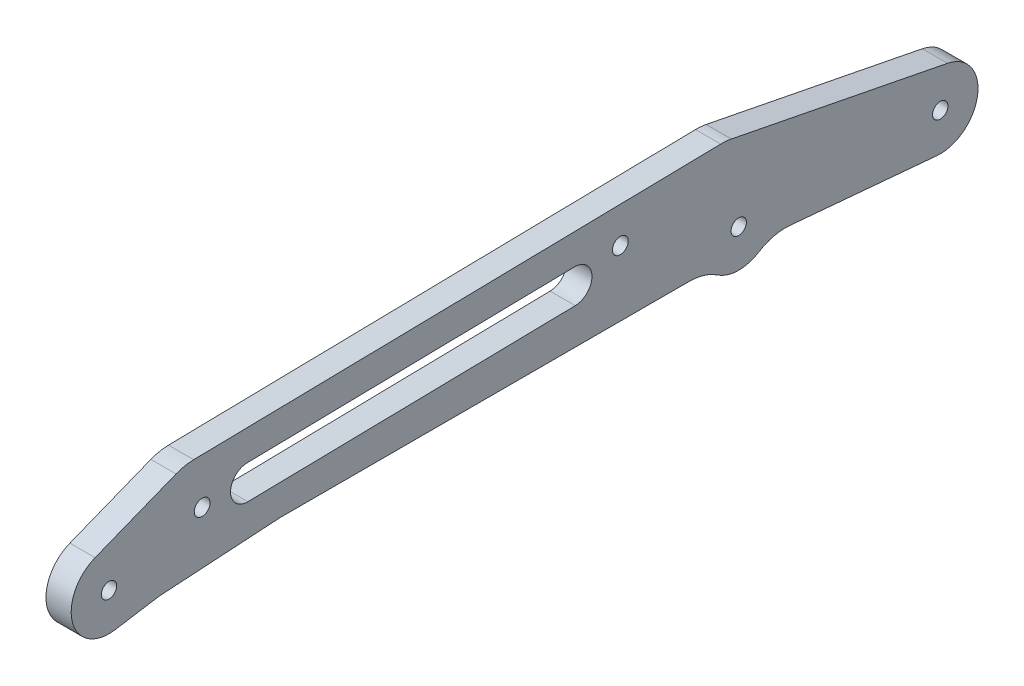
ISO-10303-21;
HEADER;
FILE_DESCRIPTION(('STEP AP214'),'2;1');
FILE_NAME('part.step','',(''),(''),'','','');
FILE_SCHEMA(('AUTOMOTIVE_DESIGN { 1 0 10303 214 1 1 1 1 }'));
ENDSEC;
DATA;
#1=APPLICATION_CONTEXT('core data for automotive mechanical design processes');
#2=APPLICATION_PROTOCOL_DEFINITION('international standard','automotive_design',2000,#1);
#3=PRODUCT_CONTEXT('',#1,'mechanical');
#4=PRODUCT('Part','Part','',(#3));
#5=PRODUCT_RELATED_PRODUCT_CATEGORY('part','',(#4));
#6=PRODUCT_DEFINITION_FORMATION('','',#4);
#7=PRODUCT_DEFINITION_CONTEXT('part definition',#1,'design');
#8=PRODUCT_DEFINITION('design','',#6,#7);
#9=PRODUCT_DEFINITION_SHAPE('','',#8);
#10=(LENGTH_UNIT() NAMED_UNIT(*) SI_UNIT(.MILLI.,.METRE.));
#11=(NAMED_UNIT(*) PLANE_ANGLE_UNIT() SI_UNIT($,.RADIAN.));
#12=(NAMED_UNIT(*) SI_UNIT($,.STERADIAN.) SOLID_ANGLE_UNIT());
#13=UNCERTAINTY_MEASURE_WITH_UNIT(LENGTH_MEASURE(1.E-05),#10,'distance_accuracy_value','');
#14=(GEOMETRIC_REPRESENTATION_CONTEXT(3) GLOBAL_UNCERTAINTY_ASSIGNED_CONTEXT((#13)) GLOBAL_UNIT_ASSIGNED_CONTEXT((#10,
#11,#12)) REPRESENTATION_CONTEXT('',''));
#15=CARTESIAN_POINT('',(0.,0.,0.));
#16=DIRECTION('',(0.,0.,1.));
#17=DIRECTION('',(1.,0.,0.));
#18=AXIS2_PLACEMENT_3D('',#15,#16,#17);
#19=CARTESIAN_POINT('',(2.5,-15.9506465412037,113.898149240446));
#20=DIRECTION('',(-1.,0.,0.));
#21=DIRECTION('',(0.,0.,1.));
#22=AXIS2_PLACEMENT_3D('',#19,#20,#21);
#23=CYLINDRICAL_SURFACE('',#22,9.99999999999999);
#24=DIRECTION('',(1.,0.,0.));
#25=VECTOR('',#24,1.);
#26=CARTESIAN_POINT('',(2.5,-6.07543657815531,115.473023262617));
#27=LINE('',#26,#25);
#28=CARTESIAN_POINT('',(-2.5,-6.0754365781553,115.473023262617));
#29=VERTEX_POINT('',#28);
#30=CARTESIAN_POINT('',(2.5,-6.07543657815531,115.473023262617));
#31=VERTEX_POINT('',#30);
#32=EDGE_CURVE('E166',#29,#31,#27,.T.);
#33=ORIENTED_EDGE('',*,*,#32,.F.);
#34=CARTESIAN_POINT('',(-2.5,-15.9506465412037,113.898149240446));
#35=DIRECTION('',(-1.,0.,0.));
#36=DIRECTION('',(0.,0.,1.));
#37=AXIS2_PLACEMENT_3D('',#34,#35,#36);
#38=CIRCLE('',#37,9.99999999999999);
#39=CARTESIAN_POINT('',(-2.5,-5.97012075637485,114.521932101997));
#40=VERTEX_POINT('',#39);
#41=EDGE_CURVE('E19',#40,#29,#38,.F.);
#42=ORIENTED_EDGE('',*,*,#41,.F.);
#43=DIRECTION('',(1.,0.,0.));
#44=VECTOR('',#43,1.);
#45=CARTESIAN_POINT('',(2.5,-5.97012075637486,114.521932101997));
#46=LINE('',#45,#44);
#47=CARTESIAN_POINT('',(2.5,-5.97012075637485,114.521932101997));
#48=VERTEX_POINT('',#47);
#49=EDGE_CURVE('E238',#40,#48,#46,.T.);
#50=ORIENTED_EDGE('',*,*,#49,.T.);
#51=CARTESIAN_POINT('',(2.5,-15.9506465412037,113.898149240446));
#52=DIRECTION('',(-1.,0.,0.));
#53=DIRECTION('',(0.,0.,1.));
#54=AXIS2_PLACEMENT_3D('',#51,#52,#53);
#55=CIRCLE('',#54,9.99999999999999);
#56=EDGE_CURVE('E167',#31,#48,#55,.T.);
#57=ORIENTED_EDGE('',*,*,#56,.F.);
#58=EDGE_LOOP('',(#33,#42,#50,#57));
#59=FACE_BOUND('',#58,.T.);
#60=ADVANCED_FACE('F16',(#59),#23,.F.);
#61=CARTESIAN_POINT('',(2.5,-14.5,90.687804581186));
#62=DIRECTION('',(1.,0.,0.));
#63=DIRECTION('',(0.,0.,-1.));
#64=AXIS2_PLACEMENT_3D('',#61,#62,#63);
#65=CYLINDRICAL_SURFACE('',#64,9.99999999999999);
#66=DIRECTION('',(1.,0.,0.));
#67=VECTOR('',#66,1.);
#68=CARTESIAN_POINT('',(2.5,-4.51947421517113,91.3115874427379));
#69=LINE('',#68,#67);
#70=CARTESIAN_POINT('',(2.5,-4.51947421517113,91.3115874427379));
#71=VERTEX_POINT('',#70);
#72=CARTESIAN_POINT('',(-2.5,-4.51947421517113,91.3115874427379));
#73=VERTEX_POINT('',#72);
#74=EDGE_CURVE('E237',#71,#73,#69,.F.);
#75=ORIENTED_EDGE('',*,*,#74,.T.);
#76=CARTESIAN_POINT('',(-2.5,-14.5,90.687804581186));
#77=DIRECTION('',(1.,0.,0.));
#78=DIRECTION('',(0.,0.,-1.));
#79=AXIS2_PLACEMENT_3D('',#76,#77,#78);
#80=CIRCLE('',#79,9.99999999999999);
#81=CARTESIAN_POINT('',(-2.5,-4.50000000000001,90.687804581186));
#82=VERTEX_POINT('',#81);
#83=EDGE_CURVE('E164',#82,#73,#80,.T.);
#84=ORIENTED_EDGE('',*,*,#83,.F.);
#85=DIRECTION('',(1.,0.,0.));
#86=VECTOR('',#85,1.);
#87=CARTESIAN_POINT('',(2.5,-4.50000000000001,90.687804581186));
#88=LINE('',#87,#86);
#89=CARTESIAN_POINT('',(2.5,-4.50000000000001,90.687804581186));
#90=VERTEX_POINT('',#89);
#91=EDGE_CURVE('E234',#82,#90,#88,.T.);
#92=ORIENTED_EDGE('',*,*,#91,.T.);
#93=CARTESIAN_POINT('',(2.5,-14.5,90.687804581186));
#94=DIRECTION('',(1.,0.,0.));
#95=DIRECTION('',(0.,0.,-1.));
#96=AXIS2_PLACEMENT_3D('',#93,#94,#95);
#97=CIRCLE('',#96,9.99999999999999);
#98=EDGE_CURVE('E322',#71,#90,#97,.F.);
#99=ORIENTED_EDGE('',*,*,#98,.F.);
#100=EDGE_LOOP('',(#75,#84,#92,#99));
#101=FACE_BOUND('',#100,.T.);
#102=ADVANCED_FACE('F330',(#101),#65,.F.);
#103=CARTESIAN_POINT('',(2.5,0.,0.));
#104=DIRECTION('',(1.,0.,0.));
#105=DIRECTION('',(0.,0.,-1.));
#106=AXIS2_PLACEMENT_3D('',#103,#104,#105);
#107=PLANE('',#106);
#108=CARTESIAN_POINT('',(2.5,0.,125.));
#109=DIRECTION('',(-1.,0.,0.));
#110=DIRECTION('',(0.,0.,1.));
#111=AXIS2_PLACEMENT_3D('',#108,#109,#110);
#112=CIRCLE('',#111,1.525);
#113=CARTESIAN_POINT('',(2.5,0.,126.525));
#114=VERTEX_POINT('',#113);
#115=EDGE_CURVE('E298',#114,#114,#112,.T.);
#116=ORIENTED_EDGE('',*,*,#115,.T.);
#117=EDGE_LOOP('',(#116));
#118=FACE_BOUND('',#117,.T.);
#119=CARTESIAN_POINT('',(2.5,0.,0.));
#120=DIRECTION('',(-1.,0.,0.));
#121=DIRECTION('',(0.,0.,1.));
#122=AXIS2_PLACEMENT_3D('',#119,#120,#121);
#123=CIRCLE('',#122,1.525);
#124=CARTESIAN_POINT('',(2.5,0.,1.525));
#125=VERTEX_POINT('',#124);
#126=EDGE_CURVE('E191',#125,#125,#123,.T.);
#127=ORIENTED_EDGE('',*,*,#126,.T.);
#128=EDGE_LOOP('',(#127));
#129=FACE_BOUND('',#128,.T.);
#130=CARTESIAN_POINT('',(2.5,4.80591857120444,97.4943767977606));
#131=DIRECTION('',(-1.,0.,0.));
#132=DIRECTION('',(0.,0.,1.));
#133=AXIS2_PLACEMENT_3D('',#130,#131,#132);
#134=CIRCLE('',#133,3.375);
#135=CARTESIAN_POINT('',(2.5,1.43150251912931,97.4315969642336));
#136=VERTEX_POINT('',#135);
#137=CARTESIAN_POINT('',(2.5,8.18033462327958,97.5571566312875));
#138=VERTEX_POINT('',#137);
#139=EDGE_CURVE('E198',#136,#138,#134,.T.);
#140=ORIENTED_EDGE('',*,*,#139,.T.);
#141=DIRECTION('',(0.,-0.0186014321561424,0.999826978392632));
#142=VECTOR('',#141,1.);
#143=CARTESIAN_POINT('',(2.5,9.99189296650175,0.185895683097711));
#144=LINE('',#143,#142);
#145=CARTESIAN_POINT('',(2.5,9.38942771342883,32.5684030357665));
#146=VERTEX_POINT('',#145);
#147=EDGE_CURVE('E194',#138,#146,#144,.F.);
#148=ORIENTED_EDGE('',*,*,#147,.T.);
#149=CARTESIAN_POINT('',(2.5,6.0150116613537,32.5056232022395));
#150=DIRECTION('',(-1.,0.,0.));
#151=DIRECTION('',(0.,0.,1.));
#152=AXIS2_PLACEMENT_3D('',#149,#150,#151);
#153=CIRCLE('',#152,3.375);
#154=CARTESIAN_POINT('',(2.5,2.64059560927856,32.4428433687125));
#155=VERTEX_POINT('',#154);
#156=EDGE_CURVE('E192',#146,#155,#153,.T.);
#157=ORIENTED_EDGE('',*,*,#156,.T.);
#158=DIRECTION('',(0.,-0.0186014321561424,0.999826978392632));
#159=VECTOR('',#158,1.);
#160=CARTESIAN_POINT('',(2.5,3.24306086235148,0.0603360160437497));
#161=LINE('',#160,#159);
#162=EDGE_CURVE('E202',#136,#155,#161,.F.);
#163=ORIENTED_EDGE('',*,*,#162,.F.);
#164=EDGE_LOOP('',(#140,#148,#157,#163));
#165=FACE_BOUND('',#164,.T.);
#166=CARTESIAN_POINT('',(2.5,4.99999999999999,106.5));
#167=DIRECTION('',(-1.,0.,0.));
#168=DIRECTION('',(0.,0.,1.));
#169=AXIS2_PLACEMENT_3D('',#166,#167,#168);
#170=CIRCLE('',#169,1.57499999999999);
#171=CARTESIAN_POINT('',(2.5,4.99999999999999,108.075));
#172=VERTEX_POINT('',#171);
#173=EDGE_CURVE('E250',#172,#172,#170,.T.);
#174=ORIENTED_EDGE('',*,*,#173,.T.);
#175=EDGE_LOOP('',(#174));
#176=FACE_BOUND('',#175,.T.);
#177=CARTESIAN_POINT('',(2.5,8.5,23.5));
#178=DIRECTION('',(-1.,0.,0.));
#179=DIRECTION('',(0.,0.,1.));
#180=AXIS2_PLACEMENT_3D('',#177,#178,#179);
#181=CIRCLE('',#180,1.575);
#182=CARTESIAN_POINT('',(2.5,8.5,25.075));
#183=VERTEX_POINT('',#182);
#184=EDGE_CURVE('E209',#183,#183,#181,.T.);
#185=ORIENTED_EDGE('',*,*,#184,.T.);
#186=EDGE_LOOP('',(#185));
#187=FACE_BOUND('',#186,.T.);
#188=DIRECTION('',(0.,-0.0887576580011616,-0.99605325065789));
#189=VECTOR('',#188,1.);
#190=CARTESIAN_POINT('',(2.5,-3.93410522902064,0.350565560854665));
#191=LINE('',#190,#189);
#192=CARTESIAN_POINT('',(2.5,-7.47039937993417,-39.3343175649913));
#193=VERTEX_POINT('',#192);
#194=CARTESIAN_POINT('',(2.5,-4.87198454255356,-10.174472616212));
#195=VERTEX_POINT('',#194);
#196=EDGE_CURVE('E221',#193,#195,#191,.F.);
#197=ORIENTED_EDGE('',*,*,#196,.F.);
#198=CARTESIAN_POINT('',(2.5,0.,-40.));
#199=DIRECTION('',(-1.,0.,0.));
#200=DIRECTION('',(0.,0.,1.));
#201=AXIS2_PLACEMENT_3D('',#198,#199,#200);
#202=CIRCLE('',#201,7.5);
#203=CARTESIAN_POINT('',(2.5,7.35909794826338,-41.4469545216992));
#204=VERTEX_POINT('',#203);
#205=EDGE_CURVE('E218',#204,#193,#202,.T.);
#206=ORIENTED_EDGE('',*,*,#205,.F.);
#207=DIRECTION('',(0.,0.192927269559888,0.981213059768451));
#208=VECTOR('',#207,1.);
#209=CARTESIAN_POINT('',(2.5,14.9312082073686,-2.9357917752925));
#210=LINE('',#209,#208);
#211=CARTESIAN_POINT('',(2.5,15.7939988386428,1.45229414528999));
#212=VERTEX_POINT('',#211);
#213=EDGE_CURVE('E215',#212,#204,#210,.F.);
#214=ORIENTED_EDGE('',*,*,#213,.F.);
#215=CARTESIAN_POINT('',(2.5,5.98186824095833,3.38156684088887));
#216=DIRECTION('',(-1.,0.,0.));
#217=DIRECTION('',(0.,0.,1.));
#218=AXIS2_PLACEMENT_3D('',#215,#216,#217);
#219=CIRCLE('',#218,10.);
#220=CARTESIAN_POINT('',(2.5,15.9801380248846,3.56758116245029));
#221=VERTEX_POINT('',#220);
#222=EDGE_CURVE('E212',#221,#212,#219,.T.);
#223=ORIENTED_EDGE('',*,*,#222,.F.);
#224=DIRECTION('',(0.,-0.0186014321561421,0.999826978392632));
#225=VECTOR('',#224,1.);
#226=CARTESIAN_POINT('',(2.5,16.040959321814,0.298436452498867));
#227=LINE('',#226,#225);
#228=CARTESIAN_POINT('',(2.5,14.0336689941836,108.190291562629));
#229=VERTEX_POINT('',#228);
#230=EDGE_CURVE('E206',#229,#221,#227,.F.);
#231=ORIENTED_EDGE('',*,*,#230,.F.);
#232=CARTESIAN_POINT('',(2.5,4.03539921025731,108.004277241067));
#233=DIRECTION('',(-1.,0.,0.));
#234=DIRECTION('',(0.,0.,1.));
#235=AXIS2_PLACEMENT_3D('',#232,#233,#234);
#236=CIRCLE('',#235,9.99999999999999);
#237=CARTESIAN_POINT('',(2.5,13.3341269732446,111.683089819856));
#238=VERTEX_POINT('',#237);
#239=EDGE_CURVE('E259',#238,#229,#236,.T.);
#240=ORIENTED_EDGE('',*,*,#239,.F.);
#241=DIRECTION('',(0.,-0.367881257878812,0.929872776298727));
#242=VECTOR('',#241,1.);
#243=CARTESIAN_POINT('',(2.5,49.7343916487453,19.6761869214032));
#244=LINE('',#243,#242);
#245=CARTESIAN_POINT('',(2.5,6.97404582224044,127.759109434091));
#246=VERTEX_POINT('',#245);
#247=EDGE_CURVE('E248',#246,#238,#244,.F.);
#248=ORIENTED_EDGE('',*,*,#247,.F.);
#249=CARTESIAN_POINT('',(2.5,0.,125.));
#250=DIRECTION('',(-1.,0.,0.));
#251=DIRECTION('',(0.,0.,1.));
#252=AXIS2_PLACEMENT_3D('',#249,#250,#251);
#253=CIRCLE('',#252,7.50000000000001);
#254=CARTESIAN_POINT('',(2.5,-7.40640747228635,123.818844483372));
#255=VERTEX_POINT('',#254);
#256=EDGE_CURVE('E171',#255,#246,#253,.T.);
#257=ORIENTED_EDGE('',*,*,#256,.F.);
#258=DIRECTION('',(0.,0.157487402217094,-0.987520996304844));
#259=VECTOR('',#258,1.);
#260=CARTESIAN_POINT('',(2.5,12.0338570705745,1.91912971550789));
#261=LINE('',#260,#259);
#262=EDGE_CURVE('E170',#31,#255,#261,.F.);
#263=ORIENTED_EDGE('',*,*,#262,.F.);
#264=ORIENTED_EDGE('',*,*,#56,.T.);
#265=DIRECTION('',(0.,-0.0623782861551807,0.998052578482889));
#266=VECTOR('',#265,1.);
#267=CARTESIAN_POINT('',(2.5,1.18287937743191,0.0739299610894947));
#268=LINE('',#267,#266);
#269=EDGE_CURVE('E240',#48,#71,#268,.F.);
#270=ORIENTED_EDGE('',*,*,#269,.T.);
#271=ORIENTED_EDGE('',*,*,#98,.T.);
#272=DIRECTION('',(0.,0.,1.));
#273=VECTOR('',#272,1.);
#274=CARTESIAN_POINT('',(2.5,-4.50000000000001,0.));
#275=LINE('',#274,#273);
#276=CARTESIAN_POINT('',(2.5,-4.50000000000001,9.7979589711327));
#277=VERTEX_POINT('',#276);
#278=EDGE_CURVE('E233',#90,#277,#275,.F.);
#279=ORIENTED_EDGE('',*,*,#278,.T.);
#280=CARTESIAN_POINT('',(2.5,-14.5,9.7979589711327));
#281=DIRECTION('',(-1.,0.,0.));
#282=DIRECTION('',(0.,0.,1.));
#283=AXIS2_PLACEMENT_3D('',#280,#281,#282);
#284=CIRCLE('',#283,10.);
#285=CARTESIAN_POINT('',(2.5,-6.21428571428572,4.19912527334258));
#286=VERTEX_POINT('',#285);
#287=EDGE_CURVE('E232',#277,#286,#284,.T.);
#288=ORIENTED_EDGE('',*,*,#287,.T.);
#289=CARTESIAN_POINT('',(2.5,0.,0.));
#290=DIRECTION('',(-1.,0.,0.));
#291=DIRECTION('',(0.,0.,1.));
#292=AXIS2_PLACEMENT_3D('',#289,#290,#291);
#293=CIRCLE('',#292,7.5);
#294=CARTESIAN_POINT('',(2.5,-6.35679302105677,-3.98009830122875));
#295=VERTEX_POINT('',#294);
#296=EDGE_CURVE('E228',#295,#286,#293,.T.);
#297=ORIENTED_EDGE('',*,*,#296,.F.);
#298=CARTESIAN_POINT('',(2.5,-14.8325170491325,-9.28689603620041));
#299=DIRECTION('',(-1.,0.,0.));
#300=DIRECTION('',(0.,0.,1.));
#301=AXIS2_PLACEMENT_3D('',#298,#299,#300);
#302=CIRCLE('',#301,10.);
#303=EDGE_CURVE('E225',#295,#195,#302,.T.);
#304=ORIENTED_EDGE('',*,*,#303,.T.);
#305=EDGE_LOOP('',(#197,#206,#214,#223,#231,#240,#248,#257,#263,#264,#270,#271,#279,#288,#297,#304));
#306=FACE_BOUND('',#305,.T.);
#307=CARTESIAN_POINT('',(2.5,0.,-40.));
#308=DIRECTION('',(-1.,0.,0.));
#309=DIRECTION('',(0.,0.,1.));
#310=AXIS2_PLACEMENT_3D('',#307,#308,#309);
#311=CIRCLE('',#310,1.525);
#312=CARTESIAN_POINT('',(2.5,0.,-38.475));
#313=VERTEX_POINT('',#312);
#314=EDGE_CURVE('E319',#313,#313,#311,.T.);
#315=ORIENTED_EDGE('',*,*,#314,.T.);
#316=EDGE_LOOP('',(#315));
#317=FACE_BOUND('',#316,.T.);
#318=ADVANCED_FACE('F336',(#118,#129,#165,#176,#187,#306,#317),#107,.T.);
#319=CARTESIAN_POINT('',(2.5,0.,-40.));
#320=DIRECTION('',(-1.,0.,0.));
#321=DIRECTION('',(0.,0.,1.));
#322=AXIS2_PLACEMENT_3D('',#319,#320,#321);
#323=CYLINDRICAL_SURFACE('',#322,1.525);
#324=CARTESIAN_POINT('',(-2.5,0.,-40.));
#325=DIRECTION('',(-1.,0.,0.));
#326=DIRECTION('',(0.,0.,1.));
#327=AXIS2_PLACEMENT_3D('',#324,#325,#326);
#328=CIRCLE('',#327,1.525);
#329=CARTESIAN_POINT('',(-2.5,0.,-38.475));
#330=VERTEX_POINT('',#329);
#331=EDGE_CURVE('E295',#330,#330,#328,.T.);
#332=ORIENTED_EDGE('',*,*,#331,.T.);
#333=EDGE_LOOP('',(#332));
#334=FACE_BOUND('',#333,.T.);
#335=ORIENTED_EDGE('',*,*,#314,.F.);
#336=EDGE_LOOP('',(#335));
#337=FACE_BOUND('',#336,.T.);
#338=ADVANCED_FACE('F593',(#334,#337),#323,.F.);
#339=CARTESIAN_POINT('',(2.5,4.03539921025731,108.004277241067));
#340=DIRECTION('',(-1.,0.,0.));
#341=DIRECTION('',(0.,0.,1.));
#342=AXIS2_PLACEMENT_3D('',#339,#340,#341);
#343=CYLINDRICAL_SURFACE('',#342,9.99999999999999);
#344=CARTESIAN_POINT('',(-2.5,4.03539921025731,108.004277241067));
#345=DIRECTION('',(-1.,0.,0.));
#346=DIRECTION('',(0.,0.,1.));
#347=AXIS2_PLACEMENT_3D('',#344,#345,#346);
#348=CIRCLE('',#347,9.99999999999999);
#349=CARTESIAN_POINT('',(-2.5,14.0336689941836,108.190291562629));
#350=VERTEX_POINT('',#349);
#351=CARTESIAN_POINT('',(-2.5,13.3341269732446,111.683089819856));
#352=VERTEX_POINT('',#351);
#353=EDGE_CURVE('E187',#350,#352,#348,.F.);
#354=ORIENTED_EDGE('',*,*,#353,.T.);
#355=DIRECTION('',(1.,0.,0.));
#356=VECTOR('',#355,1.);
#357=CARTESIAN_POINT('',(2.5,13.3341269732446,111.683089819856));
#358=LINE('',#357,#356);
#359=EDGE_CURVE('E246',#238,#352,#358,.F.);
#360=ORIENTED_EDGE('',*,*,#359,.F.);
#361=ORIENTED_EDGE('',*,*,#239,.T.);
#362=DIRECTION('',(1.,0.,0.));
#363=VECTOR('',#362,1.);
#364=CARTESIAN_POINT('',(2.5,14.0336689941836,108.190291562629));
#365=LINE('',#364,#363);
#366=EDGE_CURVE('E205',#350,#229,#365,.T.);
#367=ORIENTED_EDGE('',*,*,#366,.F.);
#368=EDGE_LOOP('',(#354,#360,#361,#367));
#369=FACE_BOUND('',#368,.T.);
#370=ADVANCED_FACE('F350',(#369),#343,.T.);
#371=CARTESIAN_POINT('',(2.5,49.7343916487453,19.6761869214032));
#372=DIRECTION('',(0.,0.929872776298727,0.367881257878812));
#373=DIRECTION('',(0.,-0.367881257878812,0.929872776298727));
#374=AXIS2_PLACEMENT_3D('',#371,#372,#373);
#375=PLANE('',#374);
#376=DIRECTION('',(0.,-0.367881257878812,0.929872776298727));
#377=VECTOR('',#376,1.);
#378=CARTESIAN_POINT('',(-2.5,13.3341269732446,111.683089819856));
#379=LINE('',#378,#377);
#380=CARTESIAN_POINT('',(-2.5,6.97404582224044,127.759109434091));
#381=VERTEX_POINT('',#380);
#382=EDGE_CURVE('E181',#352,#381,#379,.T.);
#383=ORIENTED_EDGE('',*,*,#382,.T.);
#384=DIRECTION('',(-1.,0.,0.));
#385=VECTOR('',#384,1.);
#386=CARTESIAN_POINT('',(2.5,6.97404582224044,127.759109434091));
#387=LINE('',#386,#385);
#388=EDGE_CURVE('E244',#246,#381,#387,.T.);
#389=ORIENTED_EDGE('',*,*,#388,.F.);
#390=ORIENTED_EDGE('',*,*,#247,.T.);
#391=ORIENTED_EDGE('',*,*,#359,.T.);
#392=EDGE_LOOP('',(#383,#389,#390,#391));
#393=FACE_BOUND('',#392,.T.);
#394=ADVANCED_FACE('F347',(#393),#375,.T.);
#395=CARTESIAN_POINT('',(2.5,0.,125.));
#396=DIRECTION('',(-1.,0.,0.));
#397=DIRECTION('',(0.,0.,1.));
#398=AXIS2_PLACEMENT_3D('',#395,#396,#397);
#399=CYLINDRICAL_SURFACE('',#398,7.50000000000001);
#400=CARTESIAN_POINT('',(-2.5,0.,125.));
#401=DIRECTION('',(-1.,0.,0.));
#402=DIRECTION('',(0.,0.,1.));
#403=AXIS2_PLACEMENT_3D('',#400,#401,#402);
#404=CIRCLE('',#403,7.50000000000001);
#405=CARTESIAN_POINT('',(-2.5,-7.40640747228635,123.818844483372));
#406=VERTEX_POINT('',#405);
#407=EDGE_CURVE('E177',#381,#406,#404,.F.);
#408=ORIENTED_EDGE('',*,*,#407,.T.);
#409=DIRECTION('',(1.,0.,0.));
#410=VECTOR('',#409,1.);
#411=CARTESIAN_POINT('',(2.5,-7.40640747228636,123.818844483372));
#412=LINE('',#411,#410);
#413=EDGE_CURVE('E176',#255,#406,#412,.F.);
#414=ORIENTED_EDGE('',*,*,#413,.F.);
#415=ORIENTED_EDGE('',*,*,#256,.T.);
#416=ORIENTED_EDGE('',*,*,#388,.T.);
#417=EDGE_LOOP('',(#408,#414,#415,#416));
#418=FACE_BOUND('',#417,.T.);
#419=ADVANCED_FACE('F344',(#418),#399,.T.);
#420=CARTESIAN_POINT('',(2.5,12.0338570705745,1.91912971550789));
#421=DIRECTION('',(0.,-0.987520996304844,-0.157487402217094));
#422=DIRECTION('',(0.,0.157487402217094,-0.987520996304844));
#423=AXIS2_PLACEMENT_3D('',#420,#421,#422);
#424=PLANE('',#423);
#425=ORIENTED_EDGE('',*,*,#262,.T.);
#426=ORIENTED_EDGE('',*,*,#413,.T.);
#427=DIRECTION('',(0.,0.157487402217095,-0.987520996304844));
#428=VECTOR('',#427,1.);
#429=CARTESIAN_POINT('',(-2.5,-7.40640747228635,123.818844483372));
#430=LINE('',#429,#428);
#431=EDGE_CURVE('E161',#406,#29,#430,.T.);
#432=ORIENTED_EDGE('',*,*,#431,.T.);
#433=ORIENTED_EDGE('',*,*,#32,.T.);
#434=EDGE_LOOP('',(#425,#426,#432,#433));
#435=FACE_BOUND('',#434,.T.);
#436=ADVANCED_FACE('F174',(#435),#424,.T.);
#437=CARTESIAN_POINT('',(2.5,1.18287937743191,0.0739299610894947));
#438=DIRECTION('',(0.,0.998052578482889,0.0623782861551807));
#439=DIRECTION('',(0.,-0.0623782861551807,0.998052578482889));
#440=AXIS2_PLACEMENT_3D('',#437,#438,#439);
#441=PLANE('',#440);
#442=ORIENTED_EDGE('',*,*,#74,.F.);
#443=ORIENTED_EDGE('',*,*,#269,.F.);
#444=ORIENTED_EDGE('',*,*,#49,.F.);
#445=DIRECTION('',(0.,0.0623782861551807,-0.998052578482889));
#446=VECTOR('',#445,1.);
#447=CARTESIAN_POINT('',(-2.5,-5.97012075637486,114.521932101997));
#448=LINE('',#447,#446);
#449=EDGE_CURVE('E163',#40,#73,#448,.T.);
#450=ORIENTED_EDGE('',*,*,#449,.T.);
#451=EDGE_LOOP('',(#442,#443,#444,#450));
#452=FACE_BOUND('',#451,.T.);
#453=ADVANCED_FACE('F333',(#452),#441,.F.);
#454=CARTESIAN_POINT('',(2.5,-4.50000000000001,0.));
#455=DIRECTION('',(0.,1.,0.));
#456=DIRECTION('',(0.,0.,1.));
#457=AXIS2_PLACEMENT_3D('',#454,#455,#456);
#458=PLANE('',#457);
#459=ORIENTED_EDGE('',*,*,#91,.F.);
#460=DIRECTION('',(0.,0.,-1.));
#461=VECTOR('',#460,1.);
#462=CARTESIAN_POINT('',(-2.5,-4.50000000000001,0.));
#463=LINE('',#462,#461);
#464=CARTESIAN_POINT('',(-2.5,-4.50000000000001,9.7979589711327));
#465=VERTEX_POINT('',#464);
#466=EDGE_CURVE('E179',#82,#465,#463,.T.);
#467=ORIENTED_EDGE('',*,*,#466,.T.);
#468=DIRECTION('',(-1.,0.,0.));
#469=VECTOR('',#468,1.);
#470=CARTESIAN_POINT('',(2.5,-4.50000000000001,9.7979589711327));
#471=LINE('',#470,#469);
#472=EDGE_CURVE('E229',#465,#277,#471,.F.);
#473=ORIENTED_EDGE('',*,*,#472,.T.);
#474=ORIENTED_EDGE('',*,*,#278,.F.);
#475=EDGE_LOOP('',(#459,#467,#473,#474));
#476=FACE_BOUND('',#475,.T.);
#477=ADVANCED_FACE('F374',(#476),#458,.F.);
#478=CARTESIAN_POINT('',(2.5,-14.5,9.7979589711327));
#479=DIRECTION('',(-1.,0.,0.));
#480=DIRECTION('',(0.,0.,1.));
#481=AXIS2_PLACEMENT_3D('',#478,#479,#480);
#482=CYLINDRICAL_SURFACE('',#481,10.);
#483=ORIENTED_EDGE('',*,*,#472,.F.);
#484=CARTESIAN_POINT('',(-2.5,-14.5,9.7979589711327));
#485=DIRECTION('',(-1.,0.,0.));
#486=DIRECTION('',(0.,0.,1.));
#487=AXIS2_PLACEMENT_3D('',#484,#485,#486);
#488=CIRCLE('',#487,10.);
#489=CARTESIAN_POINT('',(-2.5,-6.21428571428572,4.19912527334258));
#490=VERTEX_POINT('',#489);
#491=EDGE_CURVE('E290',#465,#490,#488,.T.);
#492=ORIENTED_EDGE('',*,*,#491,.T.);
#493=DIRECTION('',(-1.,0.,0.));
#494=VECTOR('',#493,1.);
#495=CARTESIAN_POINT('',(2.5,-6.21428571428572,4.19912527334258));
#496=LINE('',#495,#494);
#497=EDGE_CURVE('E226',#286,#490,#496,.T.);
#498=ORIENTED_EDGE('',*,*,#497,.F.);
#499=ORIENTED_EDGE('',*,*,#287,.F.);
#500=EDGE_LOOP('',(#483,#492,#498,#499));
#501=FACE_BOUND('',#500,.T.);
#502=ADVANCED_FACE('F378',(#501),#482,.F.);
#503=CARTESIAN_POINT('',(2.5,0.,0.));
#504=DIRECTION('',(-1.,0.,0.));
#505=DIRECTION('',(0.,0.,1.));
#506=AXIS2_PLACEMENT_3D('',#503,#504,#505);
#507=CYLINDRICAL_SURFACE('',#506,7.5);
#508=ORIENTED_EDGE('',*,*,#296,.T.);
#509=ORIENTED_EDGE('',*,*,#497,.T.);
#510=CARTESIAN_POINT('',(-2.5,0.,0.));
#511=DIRECTION('',(-1.,0.,0.));
#512=DIRECTION('',(0.,0.,1.));
#513=AXIS2_PLACEMENT_3D('',#510,#511,#512);
#514=CIRCLE('',#513,7.5);
#515=CARTESIAN_POINT('',(-2.5,-6.35679302105677,-3.98009830122875));
#516=VERTEX_POINT('',#515);
#517=EDGE_CURVE('E287',#490,#516,#514,.F.);
#518=ORIENTED_EDGE('',*,*,#517,.T.);
#519=DIRECTION('',(-1.,0.,0.));
#520=VECTOR('',#519,1.);
#521=CARTESIAN_POINT('',(2.5,-6.35679302105677,-3.98009830122875));
#522=LINE('',#521,#520);
#523=EDGE_CURVE('E222',#516,#295,#522,.F.);
#524=ORIENTED_EDGE('',*,*,#523,.T.);
#525=EDGE_LOOP('',(#508,#509,#518,#524));
#526=FACE_BOUND('',#525,.T.);
#527=ADVANCED_FACE('F381',(#526),#507,.T.);
#528=CARTESIAN_POINT('',(2.5,-14.8325170491325,-9.28689603620041));
#529=DIRECTION('',(-1.,0.,0.));
#530=DIRECTION('',(0.,0.,1.));
#531=AXIS2_PLACEMENT_3D('',#528,#529,#530);
#532=CYLINDRICAL_SURFACE('',#531,10.);
#533=ORIENTED_EDGE('',*,*,#523,.F.);
#534=CARTESIAN_POINT('',(-2.5,-14.8325170491325,-9.28689603620041));
#535=DIRECTION('',(-1.,0.,0.));
#536=DIRECTION('',(0.,0.,1.));
#537=AXIS2_PLACEMENT_3D('',#534,#535,#536);
#538=CIRCLE('',#537,10.);
#539=CARTESIAN_POINT('',(-2.5,-4.87198454255356,-10.174472616212));
#540=VERTEX_POINT('',#539);
#541=EDGE_CURVE('E284',#516,#540,#538,.T.);
#542=ORIENTED_EDGE('',*,*,#541,.T.);
#543=DIRECTION('',(1.,0.,0.));
#544=VECTOR('',#543,1.);
#545=CARTESIAN_POINT('',(2.5,-4.87198454255356,-10.174472616212));
#546=LINE('',#545,#544);
#547=EDGE_CURVE('E219',#195,#540,#546,.F.);
#548=ORIENTED_EDGE('',*,*,#547,.F.);
#549=ORIENTED_EDGE('',*,*,#303,.F.);
#550=EDGE_LOOP('',(#533,#542,#548,#549));
#551=FACE_BOUND('',#550,.T.);
#552=ADVANCED_FACE('F386',(#551),#532,.F.);
#553=CARTESIAN_POINT('',(2.5,-3.93410522902064,0.350565560854665));
#554=DIRECTION('',(0.,-0.99605325065789,0.0887576580011616));
#555=DIRECTION('',(0.,-0.0887576580011616,-0.99605325065789));
#556=AXIS2_PLACEMENT_3D('',#553,#554,#555);
#557=PLANE('',#556);
#558=DIRECTION('',(0.,-0.0887576580011616,-0.99605325065789));
#559=VECTOR('',#558,1.);
#560=CARTESIAN_POINT('',(-2.5,-4.87198454255356,-10.174472616212));
#561=LINE('',#560,#559);
#562=CARTESIAN_POINT('',(-2.5,-7.47039937993417,-39.3343175649913));
#563=VERTEX_POINT('',#562);
#564=EDGE_CURVE('E283',#540,#563,#561,.T.);
#565=ORIENTED_EDGE('',*,*,#564,.T.);
#566=DIRECTION('',(-1.,0.,0.));
#567=VECTOR('',#566,1.);
#568=CARTESIAN_POINT('',(2.5,-7.47039937993417,-39.3343175649913));
#569=LINE('',#568,#567);
#570=EDGE_CURVE('E216',#193,#563,#569,.T.);
#571=ORIENTED_EDGE('',*,*,#570,.F.);
#572=ORIENTED_EDGE('',*,*,#196,.T.);
#573=ORIENTED_EDGE('',*,*,#547,.T.);
#574=EDGE_LOOP('',(#565,#571,#572,#573));
#575=FACE_BOUND('',#574,.T.);
#576=ADVANCED_FACE('F390',(#575),#557,.T.);
#577=CARTESIAN_POINT('',(2.5,0.,-40.));
#578=DIRECTION('',(-1.,0.,0.));
#579=DIRECTION('',(0.,0.,1.));
#580=AXIS2_PLACEMENT_3D('',#577,#578,#579);
#581=CYLINDRICAL_SURFACE('',#580,7.5);
#582=ORIENTED_EDGE('',*,*,#205,.T.);
#583=ORIENTED_EDGE('',*,*,#570,.T.);
#584=CARTESIAN_POINT('',(-2.5,0.,-40.));
#585=DIRECTION('',(-1.,0.,0.));
#586=DIRECTION('',(0.,0.,1.));
#587=AXIS2_PLACEMENT_3D('',#584,#585,#586);
#588=CIRCLE('',#587,7.5);
#589=CARTESIAN_POINT('',(-2.5,7.35909794826338,-41.4469545216992));
#590=VERTEX_POINT('',#589);
#591=EDGE_CURVE('E280',#563,#590,#588,.F.);
#592=ORIENTED_EDGE('',*,*,#591,.T.);
#593=DIRECTION('',(1.,0.,0.));
#594=VECTOR('',#593,1.);
#595=CARTESIAN_POINT('',(2.5,7.35909794826338,-41.4469545216992));
#596=LINE('',#595,#594);
#597=EDGE_CURVE('E213',#204,#590,#596,.F.);
#598=ORIENTED_EDGE('',*,*,#597,.F.);
#599=EDGE_LOOP('',(#582,#583,#592,#598));
#600=FACE_BOUND('',#599,.T.);
#601=ADVANCED_FACE('F392',(#600),#581,.T.);
#602=CARTESIAN_POINT('',(2.5,14.9312082073686,-2.9357917752925));
#603=DIRECTION('',(0.,0.981213059768451,-0.192927269559888));
#604=DIRECTION('',(0.,0.192927269559888,0.981213059768451));
#605=AXIS2_PLACEMENT_3D('',#602,#603,#604);
#606=PLANE('',#605);
#607=ORIENTED_EDGE('',*,*,#213,.T.);
#608=ORIENTED_EDGE('',*,*,#597,.T.);
#609=DIRECTION('',(0.,0.192927269559888,0.981213059768452));
#610=VECTOR('',#609,1.);
#611=CARTESIAN_POINT('',(-2.5,7.35909794826338,-41.4469545216992));
#612=LINE('',#611,#610);
#613=CARTESIAN_POINT('',(-2.5,15.7939988386428,1.45229414529));
#614=VERTEX_POINT('',#613);
#615=EDGE_CURVE('E279',#590,#614,#612,.T.);
#616=ORIENTED_EDGE('',*,*,#615,.T.);
#617=DIRECTION('',(-1.,0.,0.));
#618=VECTOR('',#617,1.);
#619=CARTESIAN_POINT('',(2.5,15.7939988386428,1.45229414528999));
#620=LINE('',#619,#618);
#621=EDGE_CURVE('E210',#212,#614,#620,.T.);
#622=ORIENTED_EDGE('',*,*,#621,.F.);
#623=EDGE_LOOP('',(#607,#608,#616,#622));
#624=FACE_BOUND('',#623,.T.);
#625=ADVANCED_FACE('F365',(#624),#606,.T.);
#626=CARTESIAN_POINT('',(2.5,5.98186824095833,3.38156684088887));
#627=DIRECTION('',(-1.,0.,0.));
#628=DIRECTION('',(0.,0.,1.));
#629=AXIS2_PLACEMENT_3D('',#626,#627,#628);
#630=CYLINDRICAL_SURFACE('',#629,10.);
#631=CARTESIAN_POINT('',(-2.5,5.98186824095833,3.38156684088887));
#632=DIRECTION('',(-1.,0.,0.));
#633=DIRECTION('',(0.,0.,1.));
#634=AXIS2_PLACEMENT_3D('',#631,#632,#633);
#635=CIRCLE('',#634,10.);
#636=CARTESIAN_POINT('',(-2.5,15.9801380248846,3.56758116245029));
#637=VERTEX_POINT('',#636);
#638=EDGE_CURVE('E276',#614,#637,#635,.F.);
#639=ORIENTED_EDGE('',*,*,#638,.T.);
#640=DIRECTION('',(1.,0.,0.));
#641=VECTOR('',#640,1.);
#642=CARTESIAN_POINT('',(2.5,15.9801380248846,3.56758116245029));
#643=LINE('',#642,#641);
#644=EDGE_CURVE('E203',#221,#637,#643,.F.);
#645=ORIENTED_EDGE('',*,*,#644,.F.);
#646=ORIENTED_EDGE('',*,*,#222,.T.);
#647=ORIENTED_EDGE('',*,*,#621,.T.);
#648=EDGE_LOOP('',(#639,#645,#646,#647));
#649=FACE_BOUND('',#648,.T.);
#650=ADVANCED_FACE('F360',(#649),#630,.T.);
#651=CARTESIAN_POINT('',(2.5,16.040959321814,0.298436452498867));
#652=DIRECTION('',(0.,0.999826978392632,0.0186014321561421));
#653=DIRECTION('',(0.,-0.0186014321561421,0.999826978392632));
#654=AXIS2_PLACEMENT_3D('',#651,#652,#653);
#655=PLANE('',#654);
#656=DIRECTION('',(0.,-0.0186014321561421,0.999826978392632));
#657=VECTOR('',#656,1.);
#658=CARTESIAN_POINT('',(-2.5,15.9801380248846,3.56758116245029));
#659=LINE('',#658,#657);
#660=EDGE_CURVE('E275',#637,#350,#659,.T.);
#661=ORIENTED_EDGE('',*,*,#660,.T.);
#662=ORIENTED_EDGE('',*,*,#366,.T.);
#663=ORIENTED_EDGE('',*,*,#230,.T.);
#664=ORIENTED_EDGE('',*,*,#644,.T.);
#665=EDGE_LOOP('',(#661,#662,#663,#664));
#666=FACE_BOUND('',#665,.T.);
#667=ADVANCED_FACE('F440',(#666),#655,.T.);
#668=CARTESIAN_POINT('',(2.5,8.5,23.5));
#669=DIRECTION('',(-1.,0.,0.));
#670=DIRECTION('',(0.,0.,1.));
#671=AXIS2_PLACEMENT_3D('',#668,#669,#670);
#672=CYLINDRICAL_SURFACE('',#671,1.575);
#673=CARTESIAN_POINT('',(-2.5,8.5,23.5));
#674=DIRECTION('',(-1.,0.,0.));
#675=DIRECTION('',(0.,0.,1.));
#676=AXIS2_PLACEMENT_3D('',#673,#674,#675);
#677=CIRCLE('',#676,1.575);
#678=CARTESIAN_POINT('',(-2.5,8.5,25.075));
#679=VERTEX_POINT('',#678);
#680=EDGE_CURVE('E272',#679,#679,#677,.T.);
#681=ORIENTED_EDGE('',*,*,#680,.T.);
#682=EDGE_LOOP('',(#681));
#683=FACE_BOUND('',#682,.T.);
#684=ORIENTED_EDGE('',*,*,#184,.F.);
#685=EDGE_LOOP('',(#684));
#686=FACE_BOUND('',#685,.T.);
#687=ADVANCED_FACE('F436',(#683,#686),#672,.F.);
#688=CARTESIAN_POINT('',(2.5,4.99999999999999,106.5));
#689=DIRECTION('',(-1.,0.,0.));
#690=DIRECTION('',(0.,0.,1.));
#691=AXIS2_PLACEMENT_3D('',#688,#689,#690);
#692=CYLINDRICAL_SURFACE('',#691,1.57499999999999);
#693=CARTESIAN_POINT('',(-2.5,4.99999999999999,106.5));
#694=DIRECTION('',(-1.,0.,0.));
#695=DIRECTION('',(0.,0.,1.));
#696=AXIS2_PLACEMENT_3D('',#693,#694,#695);
#697=CIRCLE('',#696,1.57499999999999);
#698=CARTESIAN_POINT('',(-2.5,4.99999999999999,108.075));
#699=VERTEX_POINT('',#698);
#700=EDGE_CURVE('E269',#699,#699,#697,.T.);
#701=ORIENTED_EDGE('',*,*,#700,.T.);
#702=EDGE_LOOP('',(#701));
#703=FACE_BOUND('',#702,.T.);
#704=ORIENTED_EDGE('',*,*,#173,.F.);
#705=EDGE_LOOP('',(#704));
#706=FACE_BOUND('',#705,.T.);
#707=ADVANCED_FACE('F432',(#703,#706),#692,.F.);
#708=CARTESIAN_POINT('',(2.5,3.24306086235148,0.0603360160437497));
#709=DIRECTION('',(0.,0.999826978392632,0.0186014321561424));
#710=DIRECTION('',(0.,-0.0186014321561424,0.999826978392632));
#711=AXIS2_PLACEMENT_3D('',#708,#709,#710);
#712=PLANE('',#711);
#713=ORIENTED_EDGE('',*,*,#162,.T.);
#714=DIRECTION('',(-1.,0.,0.));
#715=VECTOR('',#714,1.);
#716=CARTESIAN_POINT('',(2.5,2.64059560927856,32.4428433687125));
#717=LINE('',#716,#715);
#718=CARTESIAN_POINT('',(-2.5,2.64059560927856,32.4428433687125));
#719=VERTEX_POINT('',#718);
#720=EDGE_CURVE('E188',#155,#719,#717,.T.);
#721=ORIENTED_EDGE('',*,*,#720,.T.);
#722=DIRECTION('',(0.,-0.0186014321561424,0.999826978392632));
#723=VECTOR('',#722,1.);
#724=CARTESIAN_POINT('',(-2.5,2.64059560927856,32.4428433687125));
#725=LINE('',#724,#723);
#726=CARTESIAN_POINT('',(-2.5,1.43150251912931,97.4315969642336));
#727=VERTEX_POINT('',#726);
#728=EDGE_CURVE('E268',#719,#727,#725,.T.);
#729=ORIENTED_EDGE('',*,*,#728,.T.);
#730=DIRECTION('',(-1.,0.,0.));
#731=VECTOR('',#730,1.);
#732=CARTESIAN_POINT('',(2.5,1.43150251912931,97.4315969642336));
#733=LINE('',#732,#731);
#734=EDGE_CURVE('E199',#727,#136,#733,.F.);
#735=ORIENTED_EDGE('',*,*,#734,.T.);
#736=EDGE_LOOP('',(#713,#721,#729,#735));
#737=FACE_BOUND('',#736,.T.);
#738=ADVANCED_FACE('F428',(#737),#712,.T.);
#739=CARTESIAN_POINT('',(2.5,4.80591857120444,97.4943767977606));
#740=DIRECTION('',(-1.,0.,0.));
#741=DIRECTION('',(0.,0.,1.));
#742=AXIS2_PLACEMENT_3D('',#739,#740,#741);
#743=CYLINDRICAL_SURFACE('',#742,3.375);
#744=ORIENTED_EDGE('',*,*,#139,.F.);
#745=ORIENTED_EDGE('',*,*,#734,.F.);
#746=CARTESIAN_POINT('',(-2.5,4.80591857120444,97.4943767977606));
#747=DIRECTION('',(-1.,0.,0.));
#748=DIRECTION('',(0.,0.,1.));
#749=AXIS2_PLACEMENT_3D('',#746,#747,#748);
#750=CIRCLE('',#749,3.375);
#751=CARTESIAN_POINT('',(-2.5,8.18033462327958,97.5571566312876));
#752=VERTEX_POINT('',#751);
#753=EDGE_CURVE('E266',#727,#752,#750,.T.);
#754=ORIENTED_EDGE('',*,*,#753,.T.);
#755=DIRECTION('',(1.,0.,0.));
#756=VECTOR('',#755,1.);
#757=CARTESIAN_POINT('',(2.5,8.18033462327958,97.5571566312876));
#758=LINE('',#757,#756);
#759=EDGE_CURVE('E195',#752,#138,#758,.T.);
#760=ORIENTED_EDGE('',*,*,#759,.T.);
#761=EDGE_LOOP('',(#744,#745,#754,#760));
#762=FACE_BOUND('',#761,.T.);
#763=ADVANCED_FACE('F424',(#762),#743,.F.);
#764=CARTESIAN_POINT('',(2.5,9.99189296650175,0.185895683097711));
#765=DIRECTION('',(0.,0.999826978392632,0.0186014321561424));
#766=DIRECTION('',(0.,-0.0186014321561424,0.999826978392632));
#767=AXIS2_PLACEMENT_3D('',#764,#765,#766);
#768=PLANE('',#767);
#769=DIRECTION('',(-1.,0.,0.));
#770=VECTOR('',#769,1.);
#771=CARTESIAN_POINT('',(2.5,9.38942771342883,32.5684030357665));
#772=LINE('',#771,#770);
#773=CARTESIAN_POINT('',(-2.5,9.38942771342883,32.5684030357665));
#774=VERTEX_POINT('',#773);
#775=EDGE_CURVE('E34',#774,#146,#772,.F.);
#776=ORIENTED_EDGE('',*,*,#775,.T.);
#777=ORIENTED_EDGE('',*,*,#147,.F.);
#778=ORIENTED_EDGE('',*,*,#759,.F.);
#779=DIRECTION('',(0.,0.0186014321561424,-0.999826978392632));
#780=VECTOR('',#779,1.);
#781=CARTESIAN_POINT('',(-2.5,8.18033462327958,97.5571566312875));
#782=LINE('',#781,#780);
#783=EDGE_CURVE('E265',#752,#774,#782,.T.);
#784=ORIENTED_EDGE('',*,*,#783,.T.);
#785=EDGE_LOOP('',(#776,#777,#778,#784));
#786=FACE_BOUND('',#785,.T.);
#787=ADVANCED_FACE('F421',(#786),#768,.F.);
#788=CARTESIAN_POINT('',(2.5,6.0150116613537,32.5056232022395));
#789=DIRECTION('',(-1.,0.,0.));
#790=DIRECTION('',(0.,0.,1.));
#791=AXIS2_PLACEMENT_3D('',#788,#789,#790);
#792=CYLINDRICAL_SURFACE('',#791,3.375);
#793=ORIENTED_EDGE('',*,*,#720,.F.);
#794=ORIENTED_EDGE('',*,*,#156,.F.);
#795=ORIENTED_EDGE('',*,*,#775,.F.);
#796=CARTESIAN_POINT('',(-2.5,6.0150116613537,32.5056232022395));
#797=DIRECTION('',(-1.,0.,0.));
#798=DIRECTION('',(0.,0.,1.));
#799=AXIS2_PLACEMENT_3D('',#796,#797,#798);
#800=CIRCLE('',#799,3.375);
#801=EDGE_CURVE('E263',#774,#719,#800,.T.);
#802=ORIENTED_EDGE('',*,*,#801,.T.);
#803=EDGE_LOOP('',(#793,#794,#795,#802));
#804=FACE_BOUND('',#803,.T.);
#805=ADVANCED_FACE('F417',(#804),#792,.F.);
#806=CARTESIAN_POINT('',(2.5,0.,0.));
#807=DIRECTION('',(-1.,0.,0.));
#808=DIRECTION('',(0.,0.,1.));
#809=AXIS2_PLACEMENT_3D('',#806,#807,#808);
#810=CYLINDRICAL_SURFACE('',#809,1.525);
#811=CARTESIAN_POINT('',(-2.5,0.,0.));
#812=DIRECTION('',(-1.,0.,0.));
#813=DIRECTION('',(0.,0.,1.));
#814=AXIS2_PLACEMENT_3D('',#811,#812,#813);
#815=CIRCLE('',#814,1.525);
#816=CARTESIAN_POINT('',(-2.5,0.,1.525));
#817=VERTEX_POINT('',#816);
#818=EDGE_CURVE('E25',#817,#817,#815,.T.);
#819=ORIENTED_EDGE('',*,*,#818,.T.);
#820=EDGE_LOOP('',(#819));
#821=FACE_BOUND('',#820,.T.);
#822=ORIENTED_EDGE('',*,*,#126,.F.);
#823=EDGE_LOOP('',(#822));
#824=FACE_BOUND('',#823,.T.);
#825=ADVANCED_FACE('F409',(#821,#824),#810,.F.);
#826=CARTESIAN_POINT('',(2.5,0.,125.));
#827=DIRECTION('',(-1.,0.,0.));
#828=DIRECTION('',(0.,0.,1.));
#829=AXIS2_PLACEMENT_3D('',#826,#827,#828);
#830=CYLINDRICAL_SURFACE('',#829,1.525);
#831=CARTESIAN_POINT('',(-2.5,0.,125.));
#832=DIRECTION('',(-1.,0.,0.));
#833=DIRECTION('',(0.,0.,1.));
#834=AXIS2_PLACEMENT_3D('',#831,#832,#833);
#835=CIRCLE('',#834,1.525);
#836=CARTESIAN_POINT('',(-2.5,0.,126.525));
#837=VERTEX_POINT('',#836);
#838=EDGE_CURVE('E11',#837,#837,#835,.T.);
#839=ORIENTED_EDGE('',*,*,#838,.T.);
#840=EDGE_LOOP('',(#839));
#841=FACE_BOUND('',#840,.T.);
#842=ORIENTED_EDGE('',*,*,#115,.F.);
#843=EDGE_LOOP('',(#842));
#844=FACE_BOUND('',#843,.T.);
#845=ADVANCED_FACE('F403',(#841,#844),#830,.F.);
#846=CARTESIAN_POINT('',(-2.5,0.,0.));
#847=DIRECTION('',(1.,0.,0.));
#848=DIRECTION('',(0.,0.,-1.));
#849=AXIS2_PLACEMENT_3D('',#846,#847,#848);
#850=PLANE('',#849);
#851=ORIENTED_EDGE('',*,*,#838,.F.);
#852=EDGE_LOOP('',(#851));
#853=FACE_BOUND('',#852,.T.);
#854=ORIENTED_EDGE('',*,*,#818,.F.);
#855=EDGE_LOOP('',(#854));
#856=FACE_BOUND('',#855,.T.);
#857=ORIENTED_EDGE('',*,*,#783,.F.);
#858=ORIENTED_EDGE('',*,*,#753,.F.);
#859=ORIENTED_EDGE('',*,*,#728,.F.);
#860=ORIENTED_EDGE('',*,*,#801,.F.);
#861=EDGE_LOOP('',(#857,#858,#859,#860));
#862=FACE_BOUND('',#861,.T.);
#863=ORIENTED_EDGE('',*,*,#700,.F.);
#864=EDGE_LOOP('',(#863));
#865=FACE_BOUND('',#864,.T.);
#866=ORIENTED_EDGE('',*,*,#680,.F.);
#867=EDGE_LOOP('',(#866));
#868=FACE_BOUND('',#867,.T.);
#869=ORIENTED_EDGE('',*,*,#638,.F.);
#870=ORIENTED_EDGE('',*,*,#615,.F.);
#871=ORIENTED_EDGE('',*,*,#591,.F.);
#872=ORIENTED_EDGE('',*,*,#564,.F.);
#873=ORIENTED_EDGE('',*,*,#541,.F.);
#874=ORIENTED_EDGE('',*,*,#517,.F.);
#875=ORIENTED_EDGE('',*,*,#491,.F.);
#876=ORIENTED_EDGE('',*,*,#466,.F.);
#877=ORIENTED_EDGE('',*,*,#83,.T.);
#878=ORIENTED_EDGE('',*,*,#449,.F.);
#879=ORIENTED_EDGE('',*,*,#41,.T.);
#880=ORIENTED_EDGE('',*,*,#431,.F.);
#881=ORIENTED_EDGE('',*,*,#407,.F.);
#882=ORIENTED_EDGE('',*,*,#382,.F.);
#883=ORIENTED_EDGE('',*,*,#353,.F.);
#884=ORIENTED_EDGE('',*,*,#660,.F.);
#885=EDGE_LOOP('',(#869,#870,#871,#872,#873,#874,#875,#876,#877,#878,#879,#880,#881,#882,#883,#884));
#886=FACE_BOUND('',#885,.T.);
#887=ORIENTED_EDGE('',*,*,#331,.F.);
#888=EDGE_LOOP('',(#887));
#889=FACE_BOUND('',#888,.T.);
#890=ADVANCED_FACE('F157',(#853,#856,#862,#865,#868,#886,#889),#850,.F.);
#891=CLOSED_SHELL('',(#60,#102,#318,#338,#370,#394,#419,#436,#453,#477,#502,#527,#552,#576,#601,
#625,#650,#667,#687,#707,#738,#763,#787,#805,#825,#845,#890));
#892=MANIFOLD_SOLID_BREP('B1',#891);
#893=ADVANCED_BREP_SHAPE_REPRESENTATION('',(#18,#892),#14);
#894=SHAPE_DEFINITION_REPRESENTATION(#9,#893);
ENDSEC;
END-ISO-10303-21;
